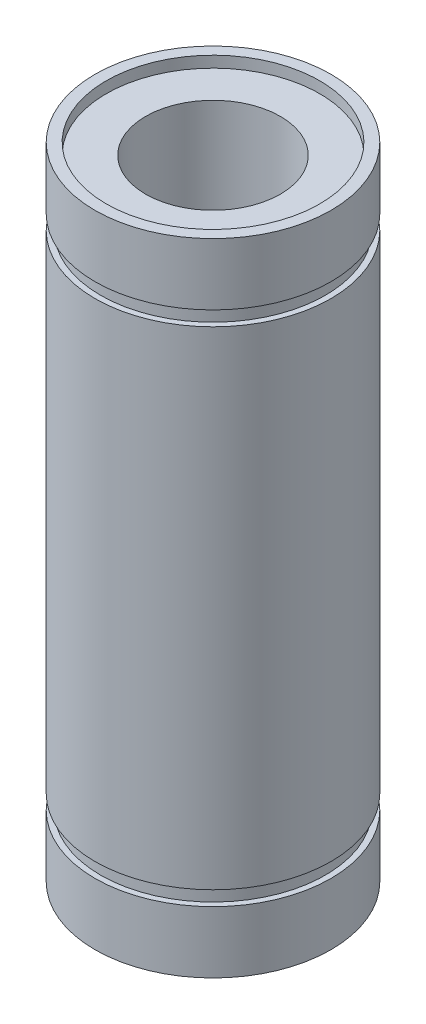
ISO-10303-21;
HEADER;
FILE_DESCRIPTION(('STEP AP214'),'2;1');
FILE_NAME('part.step','',(''),(''),'','','');
FILE_SCHEMA(('AUTOMOTIVE_DESIGN { 1 0 10303 214 1 1 1 1 }'));
ENDSEC;
DATA;
#1=APPLICATION_CONTEXT('core data for automotive mechanical design processes');
#2=APPLICATION_PROTOCOL_DEFINITION('international standard','automotive_design',2000,#1);
#3=PRODUCT_CONTEXT('',#1,'mechanical');
#4=PRODUCT('Part','Part','',(#3));
#5=PRODUCT_RELATED_PRODUCT_CATEGORY('part','',(#4));
#6=PRODUCT_DEFINITION_FORMATION('','',#4);
#7=PRODUCT_DEFINITION_CONTEXT('part definition',#1,'design');
#8=PRODUCT_DEFINITION('design','',#6,#7);
#9=PRODUCT_DEFINITION_SHAPE('','',#8);
#10=(LENGTH_UNIT() NAMED_UNIT(*) SI_UNIT(.MILLI.,.METRE.));
#11=(NAMED_UNIT(*) PLANE_ANGLE_UNIT() SI_UNIT($,.RADIAN.));
#12=(NAMED_UNIT(*) SI_UNIT($,.STERADIAN.) SOLID_ANGLE_UNIT());
#13=UNCERTAINTY_MEASURE_WITH_UNIT(LENGTH_MEASURE(1.E-05),#10,'distance_accuracy_value','');
#14=(GEOMETRIC_REPRESENTATION_CONTEXT(3) GLOBAL_UNCERTAINTY_ASSIGNED_CONTEXT((#13)) GLOBAL_UNIT_ASSIGNED_CONTEXT((#10,
#11,#12)) REPRESENTATION_CONTEXT('',''));
#15=CARTESIAN_POINT('',(0.,0.,0.));
#16=DIRECTION('',(0.,0.,1.));
#17=DIRECTION('',(1.,0.,0.));
#18=AXIS2_PLACEMENT_3D('',#15,#16,#17);
#19=CARTESIAN_POINT('',(0.,57.,0.));
#20=DIRECTION('',(0.,-1.,0.));
#21=DIRECTION('',(0.,0.,-1.));
#22=AXIS2_PLACEMENT_3D('',#19,#20,#21);
#23=CYLINDRICAL_SURFACE('',#22,10.5);
#24=CARTESIAN_POINT('',(0.,50.2,0.));
#25=DIRECTION('',(0.,1.,0.));
#26=DIRECTION('',(0.,0.,1.));
#27=AXIS2_PLACEMENT_3D('',#24,#25,#26);
#28=CIRCLE('',#27,10.5);
#29=CARTESIAN_POINT('',(0.,50.2,10.5));
#30=VERTEX_POINT('',#29);
#31=EDGE_CURVE('E75',#30,#30,#28,.T.);
#32=ORIENTED_EDGE('',*,*,#31,.F.);
#33=EDGE_LOOP('',(#32));
#34=FACE_BOUND('',#33,.T.);
#35=CARTESIAN_POINT('',(0.,6.8,0.));
#36=DIRECTION('',(0.,-1.,0.));
#37=DIRECTION('',(0.,0.,-1.));
#38=AXIS2_PLACEMENT_3D('',#35,#36,#37);
#39=CIRCLE('',#38,10.5);
#40=CARTESIAN_POINT('',(0.,6.8,-10.5));
#41=VERTEX_POINT('',#40);
#42=EDGE_CURVE('E50',#41,#41,#39,.T.);
#43=ORIENTED_EDGE('',*,*,#42,.F.);
#44=EDGE_LOOP('',(#43));
#45=FACE_BOUND('',#44,.T.);
#46=ADVANCED_FACE('F46',(#34,#45),#23,.T.);
#47=CARTESIAN_POINT('',(0.,5.5,0.));
#48=DIRECTION('',(0.,-1.,0.));
#49=DIRECTION('',(0.,0.,-1.));
#50=AXIS2_PLACEMENT_3D('',#47,#48,#49);
#51=CIRCLE('',#50,10.5);
#52=CARTESIAN_POINT('',(0.,5.5,-10.5));
#53=VERTEX_POINT('',#52);
#54=EDGE_CURVE('E79',#53,#53,#51,.T.);
#55=ORIENTED_EDGE('',*,*,#54,.T.);
#56=EDGE_LOOP('',(#55));
#57=FACE_BOUND('',#56,.T.);
#58=CARTESIAN_POINT('',(0.,0.,0.));
#59=DIRECTION('',(0.,1.,0.));
#60=DIRECTION('',(0.,0.,1.));
#61=AXIS2_PLACEMENT_3D('',#58,#59,#60);
#62=CIRCLE('',#61,10.5);
#63=CARTESIAN_POINT('',(0.,0.,10.5));
#64=VERTEX_POINT('',#63);
#65=EDGE_CURVE('E54',#64,#64,#62,.T.);
#66=ORIENTED_EDGE('',*,*,#65,.T.);
#67=EDGE_LOOP('',(#66));
#68=FACE_BOUND('',#67,.T.);
#69=ADVANCED_FACE('F119',(#57,#68),#23,.T.);
#70=CARTESIAN_POINT('',(0.,57.,0.));
#71=DIRECTION('',(0.,-1.,0.));
#72=DIRECTION('',(0.,0.,-1.));
#73=AXIS2_PLACEMENT_3D('',#70,#71,#72);
#74=CYLINDRICAL_SURFACE('',#73,6.);
#75=CARTESIAN_POINT('',(0.,56.,0.));
#76=DIRECTION('',(0.,1.,0.));
#77=DIRECTION('',(0.,0.,1.));
#78=AXIS2_PLACEMENT_3D('',#75,#76,#77);
#79=CIRCLE('',#78,6.);
#80=CARTESIAN_POINT('',(0.,56.,6.));
#81=VERTEX_POINT('',#80);
#82=EDGE_CURVE('E59',#81,#81,#79,.T.);
#83=ORIENTED_EDGE('',*,*,#82,.T.);
#84=EDGE_LOOP('',(#83));
#85=FACE_BOUND('',#84,.T.);
#86=CARTESIAN_POINT('',(0.,1.,0.));
#87=DIRECTION('',(0.,-1.,0.));
#88=DIRECTION('',(0.,0.,-1.));
#89=AXIS2_PLACEMENT_3D('',#86,#87,#88);
#90=CIRCLE('',#89,6.);
#91=CARTESIAN_POINT('',(0.,1.,-6.));
#92=VERTEX_POINT('',#91);
#93=EDGE_CURVE('E68',#92,#92,#90,.T.);
#94=ORIENTED_EDGE('',*,*,#93,.T.);
#95=EDGE_LOOP('',(#94));
#96=FACE_BOUND('',#95,.T.);
#97=ADVANCED_FACE('F112',(#85,#96),#74,.F.);
#98=CARTESIAN_POINT('',(0.,57.,0.));
#99=DIRECTION('',(0.,1.,0.));
#100=DIRECTION('',(0.,0.,1.));
#101=AXIS2_PLACEMENT_3D('',#98,#99,#100);
#102=PLANE('',#101);
#103=CARTESIAN_POINT('',(0.,57.,0.));
#104=DIRECTION('',(0.,1.,0.));
#105=DIRECTION('',(0.,0.,1.));
#106=AXIS2_PLACEMENT_3D('',#103,#104,#105);
#107=CIRCLE('',#106,9.5);
#108=CARTESIAN_POINT('',(0.,57.,9.5));
#109=VERTEX_POINT('',#108);
#110=EDGE_CURVE('E62',#109,#109,#107,.T.);
#111=ORIENTED_EDGE('',*,*,#110,.F.);
#112=EDGE_LOOP('',(#111));
#113=FACE_BOUND('',#112,.T.);
#114=CARTESIAN_POINT('',(0.,57.,0.));
#115=DIRECTION('',(0.,1.,0.));
#116=DIRECTION('',(0.,0.,1.));
#117=AXIS2_PLACEMENT_3D('',#114,#115,#116);
#118=CIRCLE('',#117,10.5);
#119=CARTESIAN_POINT('',(0.,57.,10.5));
#120=VERTEX_POINT('',#119);
#121=EDGE_CURVE('E13',#120,#120,#118,.T.);
#122=ORIENTED_EDGE('',*,*,#121,.T.);
#123=EDGE_LOOP('',(#122));
#124=FACE_BOUND('',#123,.T.);
#125=ADVANCED_FACE('F109',(#113,#124),#102,.T.);
#126=CARTESIAN_POINT('',(0.,0.,0.));
#127=DIRECTION('',(0.,1.,0.));
#128=DIRECTION('',(0.,0.,1.));
#129=AXIS2_PLACEMENT_3D('',#126,#127,#128);
#130=PLANE('',#129);
#131=CARTESIAN_POINT('',(0.,0.,0.));
#132=DIRECTION('',(0.,-1.,0.));
#133=DIRECTION('',(0.,0.,-1.));
#134=AXIS2_PLACEMENT_3D('',#131,#132,#133);
#135=CIRCLE('',#134,9.5);
#136=CARTESIAN_POINT('',(0.,0.,-9.5));
#137=VERTEX_POINT('',#136);
#138=EDGE_CURVE('E78',#137,#137,#135,.T.);
#139=ORIENTED_EDGE('',*,*,#138,.F.);
#140=EDGE_LOOP('',(#139));
#141=FACE_BOUND('',#140,.T.);
#142=ORIENTED_EDGE('',*,*,#65,.F.);
#143=EDGE_LOOP('',(#142));
#144=FACE_BOUND('',#143,.T.);
#145=ADVANCED_FACE('F111',(#141,#144),#130,.F.);
#146=CARTESIAN_POINT('',(0.,51.5,0.));
#147=DIRECTION('',(0.,1.,0.));
#148=DIRECTION('',(0.,0.,1.));
#149=AXIS2_PLACEMENT_3D('',#146,#147,#148);
#150=CIRCLE('',#149,10.5);
#151=CARTESIAN_POINT('',(0.,51.5,10.5));
#152=VERTEX_POINT('',#151);
#153=EDGE_CURVE('E72',#152,#152,#150,.T.);
#154=ORIENTED_EDGE('',*,*,#153,.T.);
#155=EDGE_LOOP('',(#154));
#156=FACE_BOUND('',#155,.T.);
#157=ORIENTED_EDGE('',*,*,#121,.F.);
#158=EDGE_LOOP('',(#157));
#159=FACE_BOUND('',#158,.T.);
#160=ADVANCED_FACE('F48',(#156,#159),#23,.T.);
#161=CARTESIAN_POINT('',(0.,56.,0.));
#162=DIRECTION('',(0.,1.,0.));
#163=DIRECTION('',(0.,0.,1.));
#164=AXIS2_PLACEMENT_3D('',#161,#162,#163);
#165=CYLINDRICAL_SURFACE('',#164,9.5);
#166=CARTESIAN_POINT('',(0.,56.,0.));
#167=DIRECTION('',(0.,1.,0.));
#168=DIRECTION('',(0.,0.,1.));
#169=AXIS2_PLACEMENT_3D('',#166,#167,#168);
#170=CIRCLE('',#169,9.5);
#171=CARTESIAN_POINT('',(0.,56.,9.5));
#172=VERTEX_POINT('',#171);
#173=EDGE_CURVE('E67',#172,#172,#170,.T.);
#174=ORIENTED_EDGE('',*,*,#173,.F.);
#175=EDGE_LOOP('',(#174));
#176=FACE_BOUND('',#175,.T.);
#177=ORIENTED_EDGE('',*,*,#110,.T.);
#178=EDGE_LOOP('',(#177));
#179=FACE_BOUND('',#178,.T.);
#180=ADVANCED_FACE('F107',(#176,#179),#165,.F.);
#181=CARTESIAN_POINT('',(0.,56.,0.));
#182=DIRECTION('',(0.,1.,0.));
#183=DIRECTION('',(0.,0.,1.));
#184=AXIS2_PLACEMENT_3D('',#181,#182,#183);
#185=PLANE('',#184);
#186=ORIENTED_EDGE('',*,*,#82,.F.);
#187=EDGE_LOOP('',(#186));
#188=FACE_BOUND('',#187,.T.);
#189=ORIENTED_EDGE('',*,*,#173,.T.);
#190=EDGE_LOOP('',(#189));
#191=FACE_BOUND('',#190,.T.);
#192=ADVANCED_FACE('F134',(#188,#191),#185,.T.);
#193=CARTESIAN_POINT('',(0.,1.,0.));
#194=DIRECTION('',(0.,-1.,0.));
#195=DIRECTION('',(0.,0.,-1.));
#196=AXIS2_PLACEMENT_3D('',#193,#194,#195);
#197=CYLINDRICAL_SURFACE('',#196,9.5);
#198=CARTESIAN_POINT('',(0.,1.,0.));
#199=DIRECTION('',(0.,-1.,0.));
#200=DIRECTION('',(0.,0.,-1.));
#201=AXIS2_PLACEMENT_3D('',#198,#199,#200);
#202=CIRCLE('',#201,9.5);
#203=CARTESIAN_POINT('',(0.,1.,-9.5));
#204=VERTEX_POINT('',#203);
#205=EDGE_CURVE('E71',#204,#204,#202,.T.);
#206=ORIENTED_EDGE('',*,*,#205,.F.);
#207=EDGE_LOOP('',(#206));
#208=FACE_BOUND('',#207,.T.);
#209=ORIENTED_EDGE('',*,*,#138,.T.);
#210=EDGE_LOOP('',(#209));
#211=FACE_BOUND('',#210,.T.);
#212=ADVANCED_FACE('F159',(#208,#211),#197,.F.);
#213=CARTESIAN_POINT('',(0.,1.,0.));
#214=DIRECTION('',(0.,-1.,0.));
#215=DIRECTION('',(0.,0.,-1.));
#216=AXIS2_PLACEMENT_3D('',#213,#214,#215);
#217=PLANE('',#216);
#218=ORIENTED_EDGE('',*,*,#93,.F.);
#219=EDGE_LOOP('',(#218));
#220=FACE_BOUND('',#219,.T.);
#221=ORIENTED_EDGE('',*,*,#205,.T.);
#222=EDGE_LOOP('',(#221));
#223=FACE_BOUND('',#222,.T.);
#224=ADVANCED_FACE('F153',(#220,#223),#217,.T.);
#225=CARTESIAN_POINT('',(0.,50.2,0.));
#226=DIRECTION('',(0.,1.,0.));
#227=DIRECTION('',(0.,0.,1.));
#228=AXIS2_PLACEMENT_3D('',#225,#226,#227);
#229=PLANE('',#228);
#230=CARTESIAN_POINT('',(0.,50.2,0.));
#231=DIRECTION('',(0.,1.,0.));
#232=DIRECTION('',(0.,0.,1.));
#233=AXIS2_PLACEMENT_3D('',#230,#231,#232);
#234=CIRCLE('',#233,10.);
#235=CARTESIAN_POINT('',(0.,50.2,10.));
#236=VERTEX_POINT('',#235);
#237=EDGE_CURVE('E76',#236,#236,#234,.T.);
#238=ORIENTED_EDGE('',*,*,#237,.F.);
#239=EDGE_LOOP('',(#238));
#240=FACE_BOUND('',#239,.T.);
#241=ORIENTED_EDGE('',*,*,#31,.T.);
#242=EDGE_LOOP('',(#241));
#243=FACE_BOUND('',#242,.T.);
#244=ADVANCED_FACE('F143',(#240,#243),#229,.T.);
#245=CARTESIAN_POINT('',(0.,51.5,0.));
#246=DIRECTION('',(0.,1.,0.));
#247=DIRECTION('',(0.,0.,1.));
#248=AXIS2_PLACEMENT_3D('',#245,#246,#247);
#249=PLANE('',#248);
#250=CARTESIAN_POINT('',(0.,51.5,0.));
#251=DIRECTION('',(0.,1.,0.));
#252=DIRECTION('',(0.,0.,1.));
#253=AXIS2_PLACEMENT_3D('',#250,#251,#252);
#254=CIRCLE('',#253,10.);
#255=CARTESIAN_POINT('',(0.,51.5,10.));
#256=VERTEX_POINT('',#255);
#257=EDGE_CURVE('E85',#256,#256,#254,.T.);
#258=ORIENTED_EDGE('',*,*,#257,.T.);
#259=EDGE_LOOP('',(#258));
#260=FACE_BOUND('',#259,.T.);
#261=ORIENTED_EDGE('',*,*,#153,.F.);
#262=EDGE_LOOP('',(#261));
#263=FACE_BOUND('',#262,.T.);
#264=ADVANCED_FACE('F140',(#260,#263),#249,.F.);
#265=CARTESIAN_POINT('',(0.,50.2,0.));
#266=DIRECTION('',(0.,1.,0.));
#267=DIRECTION('',(0.,0.,1.));
#268=AXIS2_PLACEMENT_3D('',#265,#266,#267);
#269=CYLINDRICAL_SURFACE('',#268,10.);
#270=ORIENTED_EDGE('',*,*,#237,.T.);
#271=EDGE_LOOP('',(#270));
#272=FACE_BOUND('',#271,.T.);
#273=ORIENTED_EDGE('',*,*,#257,.F.);
#274=EDGE_LOOP('',(#273));
#275=FACE_BOUND('',#274,.T.);
#276=ADVANCED_FACE('F142',(#272,#275),#269,.T.);
#277=CARTESIAN_POINT('',(0.,6.8,0.));
#278=DIRECTION('',(0.,-1.,0.));
#279=DIRECTION('',(0.,0.,-1.));
#280=AXIS2_PLACEMENT_3D('',#277,#278,#279);
#281=PLANE('',#280);
#282=CARTESIAN_POINT('',(0.,6.8,0.));
#283=DIRECTION('',(0.,-1.,0.));
#284=DIRECTION('',(0.,0.,-1.));
#285=AXIS2_PLACEMENT_3D('',#282,#283,#284);
#286=CIRCLE('',#285,10.);
#287=CARTESIAN_POINT('',(0.,6.8,-10.));
#288=VERTEX_POINT('',#287);
#289=EDGE_CURVE('E81',#288,#288,#286,.T.);
#290=ORIENTED_EDGE('',*,*,#289,.F.);
#291=EDGE_LOOP('',(#290));
#292=FACE_BOUND('',#291,.T.);
#293=ORIENTED_EDGE('',*,*,#42,.T.);
#294=EDGE_LOOP('',(#293));
#295=FACE_BOUND('',#294,.T.);
#296=ADVANCED_FACE('F150',(#292,#295),#281,.T.);
#297=CARTESIAN_POINT('',(0.,5.5,0.));
#298=DIRECTION('',(0.,-1.,0.));
#299=DIRECTION('',(0.,0.,-1.));
#300=AXIS2_PLACEMENT_3D('',#297,#298,#299);
#301=PLANE('',#300);
#302=CARTESIAN_POINT('',(0.,5.5,0.));
#303=DIRECTION('',(0.,-1.,0.));
#304=DIRECTION('',(0.,0.,-1.));
#305=AXIS2_PLACEMENT_3D('',#302,#303,#304);
#306=CIRCLE('',#305,10.);
#307=CARTESIAN_POINT('',(0.,5.5,-10.));
#308=VERTEX_POINT('',#307);
#309=EDGE_CURVE('E87',#308,#308,#306,.T.);
#310=ORIENTED_EDGE('',*,*,#309,.T.);
#311=EDGE_LOOP('',(#310));
#312=FACE_BOUND('',#311,.T.);
#313=ORIENTED_EDGE('',*,*,#54,.F.);
#314=EDGE_LOOP('',(#313));
#315=FACE_BOUND('',#314,.T.);
#316=ADVANCED_FACE('F225',(#312,#315),#301,.F.);
#317=CARTESIAN_POINT('',(0.,6.8,0.));
#318=DIRECTION('',(0.,-1.,0.));
#319=DIRECTION('',(0.,0.,-1.));
#320=AXIS2_PLACEMENT_3D('',#317,#318,#319);
#321=CYLINDRICAL_SURFACE('',#320,10.);
#322=ORIENTED_EDGE('',*,*,#289,.T.);
#323=EDGE_LOOP('',(#322));
#324=FACE_BOUND('',#323,.T.);
#325=ORIENTED_EDGE('',*,*,#309,.F.);
#326=EDGE_LOOP('',(#325));
#327=FACE_BOUND('',#326,.T.);
#328=ADVANCED_FACE('F235',(#324,#327),#321,.T.);
#329=CLOSED_SHELL('',(#46,#69,#97,#125,#145,#160,#180,#192,#212,#224,#244,#264,#276,#296,#316,#328));
#330=MANIFOLD_SOLID_BREP('B2',#329);
#331=ADVANCED_BREP_SHAPE_REPRESENTATION('',(#18,#330),#14);
#332=SHAPE_DEFINITION_REPRESENTATION(#9,#331);
ENDSEC;
END-ISO-10303-21;
